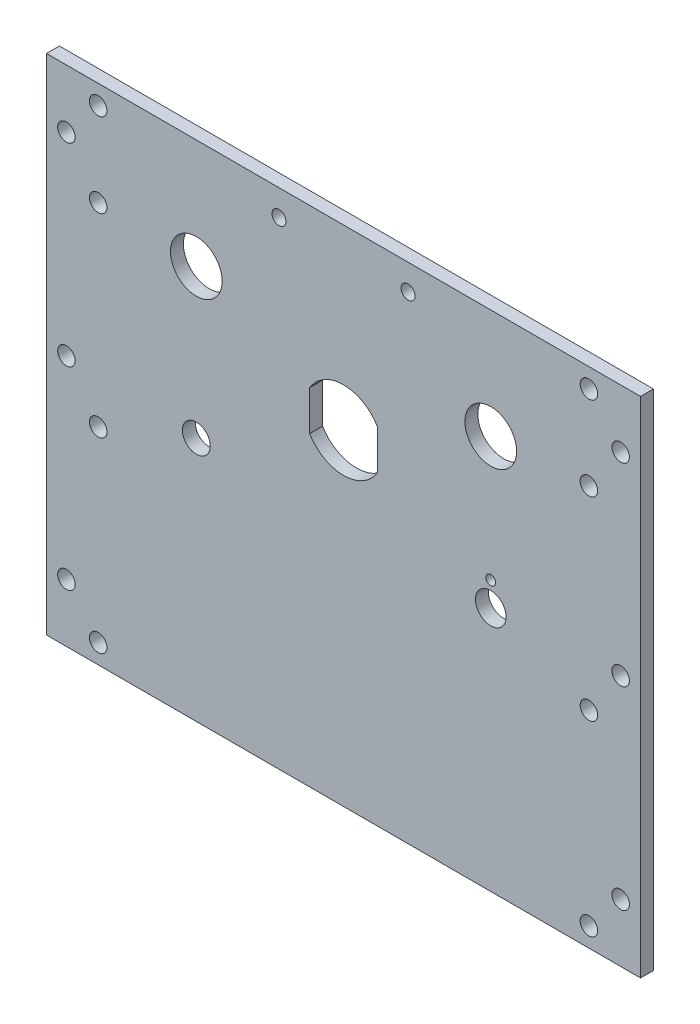
ISO-10303-21;
HEADER;
FILE_DESCRIPTION(('STEP AP214'),'2;1');
FILE_NAME('part.step','',(''),(''),'','','');
FILE_SCHEMA(('AUTOMOTIVE_DESIGN { 1 0 10303 214 1 1 1 1 }'));
ENDSEC;
DATA;
#1=APPLICATION_CONTEXT('core data for automotive mechanical design processes');
#2=APPLICATION_PROTOCOL_DEFINITION('international standard','automotive_design',2000,#1);
#3=PRODUCT_CONTEXT('',#1,'mechanical');
#4=PRODUCT('Part','Part','',(#3));
#5=PRODUCT_RELATED_PRODUCT_CATEGORY('part','',(#4));
#6=PRODUCT_DEFINITION_FORMATION('','',#4);
#7=PRODUCT_DEFINITION_CONTEXT('part definition',#1,'design');
#8=PRODUCT_DEFINITION('design','',#6,#7);
#9=PRODUCT_DEFINITION_SHAPE('','',#8);
#10=(LENGTH_UNIT() NAMED_UNIT(*) SI_UNIT(.MILLI.,.METRE.));
#11=(NAMED_UNIT(*) PLANE_ANGLE_UNIT() SI_UNIT($,.RADIAN.));
#12=(NAMED_UNIT(*) SI_UNIT($,.STERADIAN.) SOLID_ANGLE_UNIT());
#13=UNCERTAINTY_MEASURE_WITH_UNIT(LENGTH_MEASURE(1.E-05),#10,'distance_accuracy_value','');
#14=(GEOMETRIC_REPRESENTATION_CONTEXT(3) GLOBAL_UNCERTAINTY_ASSIGNED_CONTEXT((#13)) GLOBAL_UNIT_ASSIGNED_CONTEXT((#10,
#11,#12)) REPRESENTATION_CONTEXT('',''));
#15=CARTESIAN_POINT('',(0.,0.,0.));
#16=DIRECTION('',(0.,0.,1.));
#17=DIRECTION('',(1.,0.,0.));
#18=AXIS2_PLACEMENT_3D('',#15,#16,#17);
#19=CARTESIAN_POINT('',(0.,0.,-3.175));
#20=DIRECTION('',(1.,0.,0.));
#21=DIRECTION('',(0.,1.,0.));
#22=AXIS2_PLACEMENT_3D('',#19,#20,#21);
#23=PLANE('',#22);
#24=DIRECTION('',(0.,1.,0.));
#25=VECTOR('',#24,1.);
#26=CARTESIAN_POINT('',(0.,0.,0.));
#27=LINE('',#26,#25);
#28=CARTESIAN_POINT('',(0.,0.,0.));
#29=VERTEX_POINT('',#28);
#30=CARTESIAN_POINT('',(0.,123.825,0.));
#31=VERTEX_POINT('',#30);
#32=EDGE_CURVE('E268',#29,#31,#27,.T.);
#33=ORIENTED_EDGE('',*,*,#32,.F.);
#34=DIRECTION('',(0.,0.,1.));
#35=VECTOR('',#34,1.);
#36=CARTESIAN_POINT('',(0.,0.,-3.175));
#37=LINE('',#36,#35);
#38=CARTESIAN_POINT('',(0.,0.,-3.175));
#39=VERTEX_POINT('',#38);
#40=EDGE_CURVE('E13',#39,#29,#37,.T.);
#41=ORIENTED_EDGE('',*,*,#40,.F.);
#42=DIRECTION('',(0.,1.,0.));
#43=VECTOR('',#42,1.);
#44=CARTESIAN_POINT('',(0.,0.,-3.175));
#45=LINE('',#44,#43);
#46=CARTESIAN_POINT('',(0.,123.825,-3.175));
#47=VERTEX_POINT('',#46);
#48=EDGE_CURVE('E269',#39,#47,#45,.T.);
#49=ORIENTED_EDGE('',*,*,#48,.T.);
#50=DIRECTION('',(0.,0.,1.));
#51=VECTOR('',#50,1.);
#52=CARTESIAN_POINT('',(0.,123.825,-3.175));
#53=LINE('',#52,#51);
#54=EDGE_CURVE('E53',#47,#31,#53,.T.);
#55=ORIENTED_EDGE('',*,*,#54,.T.);
#56=EDGE_LOOP('',(#33,#41,#49,#55));
#57=FACE_BOUND('',#56,.T.);
#58=ADVANCED_FACE('F50',(#57),#23,.T.);
#59=CARTESIAN_POINT('',(-146.05,0.,-3.175));
#60=DIRECTION('',(0.,-1.,0.));
#61=DIRECTION('',(1.,0.,0.));
#62=AXIS2_PLACEMENT_3D('',#59,#60,#61);
#63=PLANE('',#62);
#64=DIRECTION('',(1.,0.,0.));
#65=VECTOR('',#64,1.);
#66=CARTESIAN_POINT('',(-146.05,0.,0.));
#67=LINE('',#66,#65);
#68=CARTESIAN_POINT('',(-146.05,0.,0.));
#69=VERTEX_POINT('',#68);
#70=EDGE_CURVE('E273',#69,#29,#67,.T.);
#71=ORIENTED_EDGE('',*,*,#70,.F.);
#72=DIRECTION('',(0.,0.,1.));
#73=VECTOR('',#72,1.);
#74=CARTESIAN_POINT('',(-146.05,0.,-3.175));
#75=LINE('',#74,#73);
#76=CARTESIAN_POINT('',(-146.05,0.,-3.175));
#77=VERTEX_POINT('',#76);
#78=EDGE_CURVE('E58',#77,#69,#75,.T.);
#79=ORIENTED_EDGE('',*,*,#78,.F.);
#80=DIRECTION('',(1.,0.,0.));
#81=VECTOR('',#80,1.);
#82=CARTESIAN_POINT('',(-146.05,0.,-3.175));
#83=LINE('',#82,#81);
#84=EDGE_CURVE('E279',#77,#39,#83,.T.);
#85=ORIENTED_EDGE('',*,*,#84,.T.);
#86=ORIENTED_EDGE('',*,*,#40,.T.);
#87=EDGE_LOOP('',(#71,#79,#85,#86));
#88=FACE_BOUND('',#87,.T.);
#89=ADVANCED_FACE('F304',(#88),#63,.T.);
#90=CARTESIAN_POINT('',(-146.05,123.825,-3.175));
#91=DIRECTION('',(-1.,0.,0.));
#92=DIRECTION('',(0.,0.,1.));
#93=AXIS2_PLACEMENT_3D('',#90,#91,#92);
#94=PLANE('',#93);
#95=DIRECTION('',(0.,-1.,0.));
#96=VECTOR('',#95,1.);
#97=CARTESIAN_POINT('',(-146.05,123.825,0.));
#98=LINE('',#97,#96);
#99=CARTESIAN_POINT('',(-146.05,123.825,0.));
#100=VERTEX_POINT('',#99);
#101=EDGE_CURVE('E287',#100,#69,#98,.T.);
#102=ORIENTED_EDGE('',*,*,#101,.F.);
#103=DIRECTION('',(0.,0.,1.));
#104=VECTOR('',#103,1.);
#105=CARTESIAN_POINT('',(-146.05,123.825,-3.175));
#106=LINE('',#105,#104);
#107=CARTESIAN_POINT('',(-146.05,123.825,-3.175));
#108=VERTEX_POINT('',#107);
#109=EDGE_CURVE('E292',#108,#100,#106,.T.);
#110=ORIENTED_EDGE('',*,*,#109,.F.);
#111=DIRECTION('',(0.,-1.,0.));
#112=VECTOR('',#111,1.);
#113=CARTESIAN_POINT('',(-146.05,123.825,-3.175));
#114=LINE('',#113,#112);
#115=EDGE_CURVE('E276',#108,#77,#114,.T.);
#116=ORIENTED_EDGE('',*,*,#115,.T.);
#117=ORIENTED_EDGE('',*,*,#78,.T.);
#118=EDGE_LOOP('',(#102,#110,#116,#117));
#119=FACE_BOUND('',#118,.T.);
#120=ADVANCED_FACE('F310',(#119),#94,.T.);
#121=CARTESIAN_POINT('',(0.,123.825,-3.175));
#122=DIRECTION('',(0.,1.,0.));
#123=DIRECTION('',(0.,0.,1.));
#124=AXIS2_PLACEMENT_3D('',#121,#122,#123);
#125=PLANE('',#124);
#126=DIRECTION('',(-1.,0.,0.));
#127=VECTOR('',#126,1.);
#128=CARTESIAN_POINT('',(0.,123.825,0.));
#129=LINE('',#128,#127);
#130=EDGE_CURVE('E284',#31,#100,#129,.T.);
#131=ORIENTED_EDGE('',*,*,#130,.F.);
#132=ORIENTED_EDGE('',*,*,#54,.F.);
#133=DIRECTION('',(-1.,0.,0.));
#134=VECTOR('',#133,1.);
#135=CARTESIAN_POINT('',(0.,123.825,-3.175));
#136=LINE('',#135,#134);
#137=EDGE_CURVE('E272',#47,#108,#136,.T.);
#138=ORIENTED_EDGE('',*,*,#137,.T.);
#139=ORIENTED_EDGE('',*,*,#109,.T.);
#140=EDGE_LOOP('',(#131,#132,#138,#139));
#141=FACE_BOUND('',#140,.T.);
#142=ADVANCED_FACE('F300',(#141),#125,.T.);
#143=CARTESIAN_POINT('',(0.,0.,-3.175));
#144=DIRECTION('',(0.,0.,1.));
#145=DIRECTION('',(1.,0.,0.));
#146=AXIS2_PLACEMENT_3D('',#143,#144,#145);
#147=PLANE('',#146);
#148=CARTESIAN_POINT('',(-88.9,117.475,-3.175));
#149=DIRECTION('',(0.,0.,1.));
#150=DIRECTION('',(1.,0.,0.));
#151=AXIS2_PLACEMENT_3D('',#148,#149,#150);
#152=CIRCLE('',#151,1.7272);
#153=CARTESIAN_POINT('',(-87.1728,117.475,-3.175));
#154=VERTEX_POINT('',#153);
#155=EDGE_CURVE('E605',#154,#154,#152,.T.);
#156=ORIENTED_EDGE('',*,*,#155,.T.);
#157=EDGE_LOOP('',(#156));
#158=FACE_BOUND('',#157,.T.);
#159=CARTESIAN_POINT('',(-57.15,117.475,-3.175));
#160=DIRECTION('',(0.,0.,1.));
#161=DIRECTION('',(1.,0.,0.));
#162=AXIS2_PLACEMENT_3D('',#159,#160,#161);
#163=CIRCLE('',#162,1.7272);
#164=CARTESIAN_POINT('',(-55.4228,117.475,-3.175));
#165=VERTEX_POINT('',#164);
#166=EDGE_CURVE('E139',#165,#165,#163,.T.);
#167=ORIENTED_EDGE('',*,*,#166,.T.);
#168=EDGE_LOOP('',(#167));
#169=FACE_BOUND('',#168,.T.);
#170=DIRECTION('',(0.,-1.,0.));
#171=VECTOR('',#170,1.);
#172=CARTESIAN_POINT('',(-64.7065,75.2417306764591,-3.175));
#173=LINE('',#172,#171);
#174=CARTESIAN_POINT('',(-64.7065,85.0322693235408,-3.175));
#175=VERTEX_POINT('',#174);
#176=CARTESIAN_POINT('',(-64.7065,75.2417306764591,-3.175));
#177=VERTEX_POINT('',#176);
#178=EDGE_CURVE('E145',#175,#177,#173,.T.);
#179=ORIENTED_EDGE('',*,*,#178,.F.);
#180=CARTESIAN_POINT('',(-73.025,80.137,-3.175));
#181=DIRECTION('',(0.,0.,-1.));
#182=DIRECTION('',(-1.,0.,0.));
#183=AXIS2_PLACEMENT_3D('',#180,#181,#182);
#184=CIRCLE('',#183,9.652);
#185=CARTESIAN_POINT('',(-81.3435,85.0322693235408,-3.175));
#186=VERTEX_POINT('',#185);
#187=EDGE_CURVE('E66',#186,#175,#184,.T.);
#188=ORIENTED_EDGE('',*,*,#187,.F.);
#189=DIRECTION('',(0.,1.,0.));
#190=VECTOR('',#189,1.);
#191=CARTESIAN_POINT('',(-81.3435,85.0322693235408,-3.175));
#192=LINE('',#191,#190);
#193=CARTESIAN_POINT('',(-81.3435,75.2417306764592,-3.175));
#194=VERTEX_POINT('',#193);
#195=EDGE_CURVE('E133',#194,#186,#192,.T.);
#196=ORIENTED_EDGE('',*,*,#195,.F.);
#197=CARTESIAN_POINT('',(-73.025,80.137,-3.175));
#198=DIRECTION('',(0.,0.,-1.));
#199=DIRECTION('',(-1.,0.,0.));
#200=AXIS2_PLACEMENT_3D('',#197,#198,#199);
#201=CIRCLE('',#200,9.652);
#202=EDGE_CURVE('E136',#177,#194,#201,.T.);
#203=ORIENTED_EDGE('',*,*,#202,.F.);
#204=EDGE_LOOP('',(#179,#188,#196,#203));
#205=FACE_BOUND('',#204,.T.);
#206=CARTESIAN_POINT('',(-109.22,96.901,-3.175));
#207=DIRECTION('',(0.,0.,-1.));
#208=DIRECTION('',(-1.,0.,0.));
#209=AXIS2_PLACEMENT_3D('',#206,#207,#208);
#210=CIRCLE('',#209,6.34999999999999);
#211=CARTESIAN_POINT('',(-115.57,96.901,-3.175));
#212=VERTEX_POINT('',#211);
#213=EDGE_CURVE('E151',#212,#212,#210,.T.);
#214=ORIENTED_EDGE('',*,*,#213,.F.);
#215=EDGE_LOOP('',(#214));
#216=FACE_BOUND('',#215,.T.);
#217=CARTESIAN_POINT('',(-36.8300000264727,66.3249999999963,-3.175));
#218=DIRECTION('',(0.,0.,-1.));
#219=DIRECTION('',(-1.,0.,0.));
#220=AXIS2_PLACEMENT_3D('',#217,#218,#219);
#221=CIRCLE('',#220,1.190625);
#222=CARTESIAN_POINT('',(-38.0206250264727,66.3249999999963,-3.175));
#223=VERTEX_POINT('',#222);
#224=EDGE_CURVE('E158',#223,#223,#221,.T.);
#225=ORIENTED_EDGE('',*,*,#224,.F.);
#226=EDGE_LOOP('',(#225));
#227=FACE_BOUND('',#226,.T.);
#228=CARTESIAN_POINT('',(-109.22,60.325,-3.175));
#229=DIRECTION('',(0.,0.,-1.));
#230=DIRECTION('',(-1.,0.,0.));
#231=AXIS2_PLACEMENT_3D('',#228,#229,#230);
#232=CIRCLE('',#231,3.429);
#233=CARTESIAN_POINT('',(-112.649,60.325,-3.175));
#234=VERTEX_POINT('',#233);
#235=EDGE_CURVE('E164',#234,#234,#232,.T.);
#236=ORIENTED_EDGE('',*,*,#235,.F.);
#237=EDGE_LOOP('',(#236));
#238=FACE_BOUND('',#237,.T.);
#239=CARTESIAN_POINT('',(-36.83,60.325,-3.175));
#240=DIRECTION('',(0.,0.,-1.));
#241=DIRECTION('',(-1.,0.,0.));
#242=AXIS2_PLACEMENT_3D('',#239,#240,#241);
#243=CIRCLE('',#242,3.7703125);
#244=CARTESIAN_POINT('',(-40.6003125,60.325,-3.175));
#245=VERTEX_POINT('',#244);
#246=EDGE_CURVE('E170',#245,#245,#243,.T.);
#247=ORIENTED_EDGE('',*,*,#246,.F.);
#248=EDGE_LOOP('',(#247));
#249=FACE_BOUND('',#248,.T.);
#250=CARTESIAN_POINT('',(-36.83,96.901,-3.175));
#251=DIRECTION('',(0.,0.,-1.));
#252=DIRECTION('',(-1.,0.,0.));
#253=AXIS2_PLACEMENT_3D('',#250,#251,#252);
#254=CIRCLE('',#253,6.35);
#255=CARTESIAN_POINT('',(-43.18,96.901,-3.175));
#256=VERTEX_POINT('',#255);
#257=EDGE_CURVE('E176',#256,#256,#254,.T.);
#258=ORIENTED_EDGE('',*,*,#257,.F.);
#259=EDGE_LOOP('',(#258));
#260=FACE_BOUND('',#259,.T.);
#261=CARTESIAN_POINT('',(-12.7,119.0625,-3.175));
#262=DIRECTION('',(0.,0.,-1.));
#263=DIRECTION('',(-1.,0.,0.));
#264=AXIS2_PLACEMENT_3D('',#261,#262,#263);
#265=CIRCLE('',#264,2.15265);
#266=CARTESIAN_POINT('',(-14.85265,119.0625,-3.175));
#267=VERTEX_POINT('',#266);
#268=EDGE_CURVE('E182',#267,#267,#265,.T.);
#269=ORIENTED_EDGE('',*,*,#268,.F.);
#270=EDGE_LOOP('',(#269));
#271=FACE_BOUND('',#270,.T.);
#272=CARTESIAN_POINT('',(-133.35,119.0625,-3.175));
#273=DIRECTION('',(0.,0.,-1.));
#274=DIRECTION('',(-1.,0.,0.));
#275=AXIS2_PLACEMENT_3D('',#272,#273,#274);
#276=CIRCLE('',#275,2.15265000000001);
#277=CARTESIAN_POINT('',(-135.50265,119.0625,-3.175));
#278=VERTEX_POINT('',#277);
#279=EDGE_CURVE('E190',#278,#278,#276,.T.);
#280=ORIENTED_EDGE('',*,*,#279,.F.);
#281=EDGE_LOOP('',(#280));
#282=FACE_BOUND('',#281,.T.);
#283=CARTESIAN_POINT('',(-141.1605,109.5375,-3.175));
#284=DIRECTION('',(0.,0.,-1.));
#285=DIRECTION('',(-1.,0.,0.));
#286=AXIS2_PLACEMENT_3D('',#283,#284,#285);
#287=CIRCLE('',#286,2.15265000000001);
#288=CARTESIAN_POINT('',(-143.31315,109.5375,-3.175));
#289=VERTEX_POINT('',#288);
#290=EDGE_CURVE('E196',#289,#289,#287,.T.);
#291=ORIENTED_EDGE('',*,*,#290,.F.);
#292=EDGE_LOOP('',(#291));
#293=FACE_BOUND('',#292,.T.);
#294=CARTESIAN_POINT('',(-133.35,98.425,-3.175));
#295=DIRECTION('',(0.,0.,-1.));
#296=DIRECTION('',(-1.,0.,0.));
#297=AXIS2_PLACEMENT_3D('',#294,#295,#296);
#298=CIRCLE('',#297,2.15265000000001);
#299=CARTESIAN_POINT('',(-135.50265,98.425,-3.175));
#300=VERTEX_POINT('',#299);
#301=EDGE_CURVE('E202',#300,#300,#298,.T.);
#302=ORIENTED_EDGE('',*,*,#301,.F.);
#303=EDGE_LOOP('',(#302));
#304=FACE_BOUND('',#303,.T.);
#305=CARTESIAN_POINT('',(-141.1605,61.9125,-3.175));
#306=DIRECTION('',(0.,0.,-1.));
#307=DIRECTION('',(-1.,0.,0.));
#308=AXIS2_PLACEMENT_3D('',#305,#306,#307);
#309=CIRCLE('',#308,2.15265000000001);
#310=CARTESIAN_POINT('',(-143.31315,61.9125,-3.175));
#311=VERTEX_POINT('',#310);
#312=EDGE_CURVE('E208',#311,#311,#309,.T.);
#313=ORIENTED_EDGE('',*,*,#312,.F.);
#314=EDGE_LOOP('',(#313));
#315=FACE_BOUND('',#314,.T.);
#316=CARTESIAN_POINT('',(-133.35,50.673,-3.175));
#317=DIRECTION('',(0.,0.,-1.));
#318=DIRECTION('',(-1.,0.,0.));
#319=AXIS2_PLACEMENT_3D('',#316,#317,#318);
#320=CIRCLE('',#319,2.15265000000001);
#321=CARTESIAN_POINT('',(-135.50265,50.673,-3.175));
#322=VERTEX_POINT('',#321);
#323=EDGE_CURVE('E214',#322,#322,#320,.T.);
#324=ORIENTED_EDGE('',*,*,#323,.F.);
#325=EDGE_LOOP('',(#324));
#326=FACE_BOUND('',#325,.T.);
#327=CARTESIAN_POINT('',(-133.35,4.7625,-3.175));
#328=DIRECTION('',(0.,0.,-1.));
#329=DIRECTION('',(-1.,0.,0.));
#330=AXIS2_PLACEMENT_3D('',#327,#328,#329);
#331=CIRCLE('',#330,2.15265000000001);
#332=CARTESIAN_POINT('',(-135.50265,4.7625,-3.175));
#333=VERTEX_POINT('',#332);
#334=EDGE_CURVE('E220',#333,#333,#331,.T.);
#335=ORIENTED_EDGE('',*,*,#334,.F.);
#336=EDGE_LOOP('',(#335));
#337=FACE_BOUND('',#336,.T.);
#338=CARTESIAN_POINT('',(-12.7,4.7625,-3.175));
#339=DIRECTION('',(0.,0.,-1.));
#340=DIRECTION('',(-1.,0.,0.));
#341=AXIS2_PLACEMENT_3D('',#338,#339,#340);
#342=CIRCLE('',#341,2.15265);
#343=CARTESIAN_POINT('',(-14.85265,4.7625,-3.175));
#344=VERTEX_POINT('',#343);
#345=EDGE_CURVE('E226',#344,#344,#342,.T.);
#346=ORIENTED_EDGE('',*,*,#345,.F.);
#347=EDGE_LOOP('',(#346));
#348=FACE_BOUND('',#347,.T.);
#349=CARTESIAN_POINT('',(-12.7,50.673,-3.175));
#350=DIRECTION('',(0.,0.,-1.));
#351=DIRECTION('',(-1.,0.,0.));
#352=AXIS2_PLACEMENT_3D('',#349,#350,#351);
#353=CIRCLE('',#352,2.15265);
#354=CARTESIAN_POINT('',(-14.85265,50.673,-3.175));
#355=VERTEX_POINT('',#354);
#356=EDGE_CURVE('E232',#355,#355,#353,.T.);
#357=ORIENTED_EDGE('',*,*,#356,.F.);
#358=EDGE_LOOP('',(#357));
#359=FACE_BOUND('',#358,.T.);
#360=CARTESIAN_POINT('',(-12.7,98.425,-3.175));
#361=DIRECTION('',(0.,0.,-1.));
#362=DIRECTION('',(-1.,0.,0.));
#363=AXIS2_PLACEMENT_3D('',#360,#361,#362);
#364=CIRCLE('',#363,2.15265);
#365=CARTESIAN_POINT('',(-14.85265,98.425,-3.175));
#366=VERTEX_POINT('',#365);
#367=EDGE_CURVE('E238',#366,#366,#364,.T.);
#368=ORIENTED_EDGE('',*,*,#367,.F.);
#369=EDGE_LOOP('',(#368));
#370=FACE_BOUND('',#369,.T.);
#371=CARTESIAN_POINT('',(-4.8895,109.5375,-3.175));
#372=DIRECTION('',(0.,0.,-1.));
#373=DIRECTION('',(-1.,0.,0.));
#374=AXIS2_PLACEMENT_3D('',#371,#372,#373);
#375=CIRCLE('',#374,2.15265);
#376=CARTESIAN_POINT('',(-7.04215,109.5375,-3.175));
#377=VERTEX_POINT('',#376);
#378=EDGE_CURVE('E244',#377,#377,#375,.T.);
#379=ORIENTED_EDGE('',*,*,#378,.F.);
#380=EDGE_LOOP('',(#379));
#381=FACE_BOUND('',#380,.T.);
#382=CARTESIAN_POINT('',(-141.1605,14.2875,-3.175));
#383=DIRECTION('',(0.,0.,-1.));
#384=DIRECTION('',(-1.,0.,0.));
#385=AXIS2_PLACEMENT_3D('',#382,#383,#384);
#386=CIRCLE('',#385,2.15265000000001);
#387=CARTESIAN_POINT('',(-143.31315,14.2875,-3.175));
#388=VERTEX_POINT('',#387);
#389=EDGE_CURVE('E250',#388,#388,#386,.T.);
#390=ORIENTED_EDGE('',*,*,#389,.F.);
#391=EDGE_LOOP('',(#390));
#392=FACE_BOUND('',#391,.T.);
#393=CARTESIAN_POINT('',(-4.88949999999997,14.2875,-3.175));
#394=DIRECTION('',(0.,0.,-1.));
#395=DIRECTION('',(-1.,0.,0.));
#396=AXIS2_PLACEMENT_3D('',#393,#394,#395);
#397=CIRCLE('',#396,2.15265);
#398=CARTESIAN_POINT('',(-7.04214999999997,14.2875,-3.175));
#399=VERTEX_POINT('',#398);
#400=EDGE_CURVE('E256',#399,#399,#397,.T.);
#401=ORIENTED_EDGE('',*,*,#400,.F.);
#402=EDGE_LOOP('',(#401));
#403=FACE_BOUND('',#402,.T.);
#404=CARTESIAN_POINT('',(-4.8895,61.9125,-3.175));
#405=DIRECTION('',(0.,0.,-1.));
#406=DIRECTION('',(-1.,0.,0.));
#407=AXIS2_PLACEMENT_3D('',#404,#405,#406);
#408=CIRCLE('',#407,2.15265);
#409=CARTESIAN_POINT('',(-7.04215,61.9125,-3.175));
#410=VERTEX_POINT('',#409);
#411=EDGE_CURVE('E262',#410,#410,#408,.T.);
#412=ORIENTED_EDGE('',*,*,#411,.F.);
#413=EDGE_LOOP('',(#412));
#414=FACE_BOUND('',#413,.T.);
#415=ORIENTED_EDGE('',*,*,#48,.F.);
#416=ORIENTED_EDGE('',*,*,#84,.F.);
#417=ORIENTED_EDGE('',*,*,#115,.F.);
#418=ORIENTED_EDGE('',*,*,#137,.F.);
#419=EDGE_LOOP('',(#415,#416,#417,#418));
#420=FACE_BOUND('',#419,.T.);
#421=ADVANCED_FACE('F307',(#158,#169,#205,#216,#227,#238,#249,#260,#271,#282,#293,#304,#315,
#326,#337,#348,#359,#370,#381,#392,#403,#414,#420),#147,.F.);
#422=CARTESIAN_POINT('',(0.,0.,0.));
#423=DIRECTION('',(0.,0.,1.));
#424=DIRECTION('',(1.,0.,0.));
#425=AXIS2_PLACEMENT_3D('',#422,#423,#424);
#426=PLANE('',#425);
#427=CARTESIAN_POINT('',(-88.9,117.475,0.));
#428=DIRECTION('',(0.,0.,1.));
#429=DIRECTION('',(1.,0.,0.));
#430=AXIS2_PLACEMENT_3D('',#427,#428,#429);
#431=CIRCLE('',#430,1.7272);
#432=CARTESIAN_POINT('',(-87.1728,117.475,0.));
#433=VERTEX_POINT('',#432);
#434=EDGE_CURVE('E608',#433,#433,#431,.T.);
#435=ORIENTED_EDGE('',*,*,#434,.F.);
#436=EDGE_LOOP('',(#435));
#437=FACE_BOUND('',#436,.T.);
#438=CARTESIAN_POINT('',(-57.15,117.475,0.));
#439=DIRECTION('',(0.,0.,1.));
#440=DIRECTION('',(1.,0.,0.));
#441=AXIS2_PLACEMENT_3D('',#438,#439,#440);
#442=CIRCLE('',#441,1.7272);
#443=CARTESIAN_POINT('',(-55.4228,117.475,0.));
#444=VERTEX_POINT('',#443);
#445=EDGE_CURVE('E610',#444,#444,#442,.T.);
#446=ORIENTED_EDGE('',*,*,#445,.F.);
#447=EDGE_LOOP('',(#446));
#448=FACE_BOUND('',#447,.T.);
#449=CARTESIAN_POINT('',(-73.025,80.137,0.));
#450=DIRECTION('',(0.,0.,-1.));
#451=DIRECTION('',(-1.,0.,0.));
#452=AXIS2_PLACEMENT_3D('',#449,#450,#451);
#453=CIRCLE('',#452,9.652);
#454=CARTESIAN_POINT('',(-81.3435,85.0322693235408,0.));
#455=VERTEX_POINT('',#454);
#456=CARTESIAN_POINT('',(-64.7065,85.0322693235408,0.));
#457=VERTEX_POINT('',#456);
#458=EDGE_CURVE('E117',#455,#457,#453,.T.);
#459=ORIENTED_EDGE('',*,*,#458,.T.);
#460=DIRECTION('',(0.,-1.,0.));
#461=VECTOR('',#460,1.);
#462=CARTESIAN_POINT('',(-64.7065,75.2417306764591,0.));
#463=LINE('',#462,#461);
#464=CARTESIAN_POINT('',(-64.7065,75.2417306764591,0.));
#465=VERTEX_POINT('',#464);
#466=EDGE_CURVE('E126',#457,#465,#463,.T.);
#467=ORIENTED_EDGE('',*,*,#466,.T.);
#468=CARTESIAN_POINT('',(-73.025,80.137,0.));
#469=DIRECTION('',(0.,0.,-1.));
#470=DIRECTION('',(-1.,0.,0.));
#471=AXIS2_PLACEMENT_3D('',#468,#469,#470);
#472=CIRCLE('',#471,9.652);
#473=CARTESIAN_POINT('',(-81.3435,75.2417306764592,0.));
#474=VERTEX_POINT('',#473);
#475=EDGE_CURVE('E74',#465,#474,#472,.T.);
#476=ORIENTED_EDGE('',*,*,#475,.T.);
#477=DIRECTION('',(0.,1.,0.));
#478=VECTOR('',#477,1.);
#479=CARTESIAN_POINT('',(-81.3435,85.0322693235408,0.));
#480=LINE('',#479,#478);
#481=EDGE_CURVE('E123',#474,#455,#480,.T.);
#482=ORIENTED_EDGE('',*,*,#481,.T.);
#483=EDGE_LOOP('',(#459,#467,#476,#482));
#484=FACE_BOUND('',#483,.T.);
#485=CARTESIAN_POINT('',(-109.22,96.901,0.));
#486=DIRECTION('',(0.,0.,-1.));
#487=DIRECTION('',(-1.,0.,0.));
#488=AXIS2_PLACEMENT_3D('',#485,#486,#487);
#489=CIRCLE('',#488,6.34999999999999);
#490=CARTESIAN_POINT('',(-115.57,96.901,0.));
#491=VERTEX_POINT('',#490);
#492=EDGE_CURVE('E155',#491,#491,#489,.T.);
#493=ORIENTED_EDGE('',*,*,#492,.T.);
#494=EDGE_LOOP('',(#493));
#495=FACE_BOUND('',#494,.T.);
#496=CARTESIAN_POINT('',(-36.8300000264727,66.3249999999963,0.));
#497=DIRECTION('',(0.,0.,-1.));
#498=DIRECTION('',(-1.,0.,0.));
#499=AXIS2_PLACEMENT_3D('',#496,#497,#498);
#500=CIRCLE('',#499,1.190625);
#501=CARTESIAN_POINT('',(-38.0206250264727,66.3249999999963,0.));
#502=VERTEX_POINT('',#501);
#503=EDGE_CURVE('E161',#502,#502,#500,.T.);
#504=ORIENTED_EDGE('',*,*,#503,.T.);
#505=EDGE_LOOP('',(#504));
#506=FACE_BOUND('',#505,.T.);
#507=CARTESIAN_POINT('',(-109.22,60.325,0.));
#508=DIRECTION('',(0.,0.,-1.));
#509=DIRECTION('',(-1.,0.,0.));
#510=AXIS2_PLACEMENT_3D('',#507,#508,#509);
#511=CIRCLE('',#510,3.429);
#512=CARTESIAN_POINT('',(-112.649,60.325,0.));
#513=VERTEX_POINT('',#512);
#514=EDGE_CURVE('E167',#513,#513,#511,.T.);
#515=ORIENTED_EDGE('',*,*,#514,.T.);
#516=EDGE_LOOP('',(#515));
#517=FACE_BOUND('',#516,.T.);
#518=CARTESIAN_POINT('',(-36.83,60.325,0.));
#519=DIRECTION('',(0.,0.,-1.));
#520=DIRECTION('',(-1.,0.,0.));
#521=AXIS2_PLACEMENT_3D('',#518,#519,#520);
#522=CIRCLE('',#521,3.7703125);
#523=CARTESIAN_POINT('',(-40.6003125,60.325,0.));
#524=VERTEX_POINT('',#523);
#525=EDGE_CURVE('E173',#524,#524,#522,.T.);
#526=ORIENTED_EDGE('',*,*,#525,.T.);
#527=EDGE_LOOP('',(#526));
#528=FACE_BOUND('',#527,.T.);
#529=CARTESIAN_POINT('',(-36.83,96.901,0.));
#530=DIRECTION('',(0.,0.,-1.));
#531=DIRECTION('',(-1.,0.,0.));
#532=AXIS2_PLACEMENT_3D('',#529,#530,#531);
#533=CIRCLE('',#532,6.35);
#534=CARTESIAN_POINT('',(-43.18,96.901,0.));
#535=VERTEX_POINT('',#534);
#536=EDGE_CURVE('E179',#535,#535,#533,.T.);
#537=ORIENTED_EDGE('',*,*,#536,.T.);
#538=EDGE_LOOP('',(#537));
#539=FACE_BOUND('',#538,.T.);
#540=CARTESIAN_POINT('',(-12.7,119.0625,0.));
#541=DIRECTION('',(0.,0.,-1.));
#542=DIRECTION('',(-1.,0.,0.));
#543=AXIS2_PLACEMENT_3D('',#540,#541,#542);
#544=CIRCLE('',#543,2.15265);
#545=CARTESIAN_POINT('',(-14.85265,119.0625,0.));
#546=VERTEX_POINT('',#545);
#547=EDGE_CURVE('E187',#546,#546,#544,.T.);
#548=ORIENTED_EDGE('',*,*,#547,.T.);
#549=EDGE_LOOP('',(#548));
#550=FACE_BOUND('',#549,.T.);
#551=CARTESIAN_POINT('',(-133.35,119.0625,0.));
#552=DIRECTION('',(0.,0.,-1.));
#553=DIRECTION('',(-1.,0.,0.));
#554=AXIS2_PLACEMENT_3D('',#551,#552,#553);
#555=CIRCLE('',#554,2.15265000000001);
#556=CARTESIAN_POINT('',(-135.50265,119.0625,0.));
#557=VERTEX_POINT('',#556);
#558=EDGE_CURVE('E193',#557,#557,#555,.T.);
#559=ORIENTED_EDGE('',*,*,#558,.T.);
#560=EDGE_LOOP('',(#559));
#561=FACE_BOUND('',#560,.T.);
#562=CARTESIAN_POINT('',(-141.1605,109.5375,0.));
#563=DIRECTION('',(0.,0.,-1.));
#564=DIRECTION('',(-1.,0.,0.));
#565=AXIS2_PLACEMENT_3D('',#562,#563,#564);
#566=CIRCLE('',#565,2.15265000000001);
#567=CARTESIAN_POINT('',(-143.31315,109.5375,0.));
#568=VERTEX_POINT('',#567);
#569=EDGE_CURVE('E199',#568,#568,#566,.T.);
#570=ORIENTED_EDGE('',*,*,#569,.T.);
#571=EDGE_LOOP('',(#570));
#572=FACE_BOUND('',#571,.T.);
#573=CARTESIAN_POINT('',(-133.35,98.425,0.));
#574=DIRECTION('',(0.,0.,-1.));
#575=DIRECTION('',(-1.,0.,0.));
#576=AXIS2_PLACEMENT_3D('',#573,#574,#575);
#577=CIRCLE('',#576,2.15265000000001);
#578=CARTESIAN_POINT('',(-135.50265,98.425,0.));
#579=VERTEX_POINT('',#578);
#580=EDGE_CURVE('E205',#579,#579,#577,.T.);
#581=ORIENTED_EDGE('',*,*,#580,.T.);
#582=EDGE_LOOP('',(#581));
#583=FACE_BOUND('',#582,.T.);
#584=CARTESIAN_POINT('',(-141.1605,61.9125,0.));
#585=DIRECTION('',(0.,0.,-1.));
#586=DIRECTION('',(-1.,0.,0.));
#587=AXIS2_PLACEMENT_3D('',#584,#585,#586);
#588=CIRCLE('',#587,2.15265000000001);
#589=CARTESIAN_POINT('',(-143.31315,61.9125,0.));
#590=VERTEX_POINT('',#589);
#591=EDGE_CURVE('E211',#590,#590,#588,.T.);
#592=ORIENTED_EDGE('',*,*,#591,.T.);
#593=EDGE_LOOP('',(#592));
#594=FACE_BOUND('',#593,.T.);
#595=CARTESIAN_POINT('',(-133.35,50.673,0.));
#596=DIRECTION('',(0.,0.,-1.));
#597=DIRECTION('',(-1.,0.,0.));
#598=AXIS2_PLACEMENT_3D('',#595,#596,#597);
#599=CIRCLE('',#598,2.15265000000001);
#600=CARTESIAN_POINT('',(-135.50265,50.673,0.));
#601=VERTEX_POINT('',#600);
#602=EDGE_CURVE('E217',#601,#601,#599,.T.);
#603=ORIENTED_EDGE('',*,*,#602,.T.);
#604=EDGE_LOOP('',(#603));
#605=FACE_BOUND('',#604,.T.);
#606=CARTESIAN_POINT('',(-133.35,4.7625,0.));
#607=DIRECTION('',(0.,0.,-1.));
#608=DIRECTION('',(-1.,0.,0.));
#609=AXIS2_PLACEMENT_3D('',#606,#607,#608);
#610=CIRCLE('',#609,2.15265000000001);
#611=CARTESIAN_POINT('',(-135.50265,4.7625,0.));
#612=VERTEX_POINT('',#611);
#613=EDGE_CURVE('E223',#612,#612,#610,.T.);
#614=ORIENTED_EDGE('',*,*,#613,.T.);
#615=EDGE_LOOP('',(#614));
#616=FACE_BOUND('',#615,.T.);
#617=CARTESIAN_POINT('',(-12.7,4.7625,0.));
#618=DIRECTION('',(0.,0.,-1.));
#619=DIRECTION('',(-1.,0.,0.));
#620=AXIS2_PLACEMENT_3D('',#617,#618,#619);
#621=CIRCLE('',#620,2.15265);
#622=CARTESIAN_POINT('',(-14.85265,4.7625,0.));
#623=VERTEX_POINT('',#622);
#624=EDGE_CURVE('E229',#623,#623,#621,.T.);
#625=ORIENTED_EDGE('',*,*,#624,.T.);
#626=EDGE_LOOP('',(#625));
#627=FACE_BOUND('',#626,.T.);
#628=CARTESIAN_POINT('',(-12.7,50.673,0.));
#629=DIRECTION('',(0.,0.,-1.));
#630=DIRECTION('',(-1.,0.,0.));
#631=AXIS2_PLACEMENT_3D('',#628,#629,#630);
#632=CIRCLE('',#631,2.15265);
#633=CARTESIAN_POINT('',(-14.85265,50.673,0.));
#634=VERTEX_POINT('',#633);
#635=EDGE_CURVE('E235',#634,#634,#632,.T.);
#636=ORIENTED_EDGE('',*,*,#635,.T.);
#637=EDGE_LOOP('',(#636));
#638=FACE_BOUND('',#637,.T.);
#639=CARTESIAN_POINT('',(-12.7,98.425,0.));
#640=DIRECTION('',(0.,0.,-1.));
#641=DIRECTION('',(-1.,0.,0.));
#642=AXIS2_PLACEMENT_3D('',#639,#640,#641);
#643=CIRCLE('',#642,2.15265);
#644=CARTESIAN_POINT('',(-14.85265,98.425,0.));
#645=VERTEX_POINT('',#644);
#646=EDGE_CURVE('E241',#645,#645,#643,.T.);
#647=ORIENTED_EDGE('',*,*,#646,.T.);
#648=EDGE_LOOP('',(#647));
#649=FACE_BOUND('',#648,.T.);
#650=CARTESIAN_POINT('',(-4.8895,109.5375,0.));
#651=DIRECTION('',(0.,0.,-1.));
#652=DIRECTION('',(-1.,0.,0.));
#653=AXIS2_PLACEMENT_3D('',#650,#651,#652);
#654=CIRCLE('',#653,2.15265);
#655=CARTESIAN_POINT('',(-7.04215,109.5375,0.));
#656=VERTEX_POINT('',#655);
#657=EDGE_CURVE('E247',#656,#656,#654,.T.);
#658=ORIENTED_EDGE('',*,*,#657,.T.);
#659=EDGE_LOOP('',(#658));
#660=FACE_BOUND('',#659,.T.);
#661=CARTESIAN_POINT('',(-141.1605,14.2875,0.));
#662=DIRECTION('',(0.,0.,-1.));
#663=DIRECTION('',(-1.,0.,0.));
#664=AXIS2_PLACEMENT_3D('',#661,#662,#663);
#665=CIRCLE('',#664,2.15265000000001);
#666=CARTESIAN_POINT('',(-143.31315,14.2875,0.));
#667=VERTEX_POINT('',#666);
#668=EDGE_CURVE('E253',#667,#667,#665,.T.);
#669=ORIENTED_EDGE('',*,*,#668,.T.);
#670=EDGE_LOOP('',(#669));
#671=FACE_BOUND('',#670,.T.);
#672=CARTESIAN_POINT('',(-4.88949999999997,14.2875,0.));
#673=DIRECTION('',(0.,0.,-1.));
#674=DIRECTION('',(-1.,0.,0.));
#675=AXIS2_PLACEMENT_3D('',#672,#673,#674);
#676=CIRCLE('',#675,2.15265);
#677=CARTESIAN_POINT('',(-7.04214999999997,14.2875,0.));
#678=VERTEX_POINT('',#677);
#679=EDGE_CURVE('E259',#678,#678,#676,.T.);
#680=ORIENTED_EDGE('',*,*,#679,.T.);
#681=EDGE_LOOP('',(#680));
#682=FACE_BOUND('',#681,.T.);
#683=CARTESIAN_POINT('',(-4.8895,61.9125,0.));
#684=DIRECTION('',(0.,0.,-1.));
#685=DIRECTION('',(-1.,0.,0.));
#686=AXIS2_PLACEMENT_3D('',#683,#684,#685);
#687=CIRCLE('',#686,2.15265);
#688=CARTESIAN_POINT('',(-7.04215,61.9125,0.));
#689=VERTEX_POINT('',#688);
#690=EDGE_CURVE('E265',#689,#689,#687,.T.);
#691=ORIENTED_EDGE('',*,*,#690,.T.);
#692=EDGE_LOOP('',(#691));
#693=FACE_BOUND('',#692,.T.);
#694=ORIENTED_EDGE('',*,*,#32,.T.);
#695=ORIENTED_EDGE('',*,*,#130,.T.);
#696=ORIENTED_EDGE('',*,*,#101,.T.);
#697=ORIENTED_EDGE('',*,*,#70,.T.);
#698=EDGE_LOOP('',(#694,#695,#696,#697));
#699=FACE_BOUND('',#698,.T.);
#700=ADVANCED_FACE('F130',(#437,#448,#484,#495,#506,#517,#528,#539,#550,#561,#572,#583,#594,
#605,#616,#627,#638,#649,#660,#671,#682,#693,#699),#426,.T.);
#701=CARTESIAN_POINT('',(-4.8895,61.9125,-3.175));
#702=DIRECTION('',(0.,0.,-1.));
#703=DIRECTION('',(-1.,0.,0.));
#704=AXIS2_PLACEMENT_3D('',#701,#702,#703);
#705=CYLINDRICAL_SURFACE('',#704,2.15265);
#706=ORIENTED_EDGE('',*,*,#690,.F.);
#707=EDGE_LOOP('',(#706));
#708=FACE_BOUND('',#707,.T.);
#709=ORIENTED_EDGE('',*,*,#411,.T.);
#710=EDGE_LOOP('',(#709));
#711=FACE_BOUND('',#710,.T.);
#712=ADVANCED_FACE('F342',(#708,#711),#705,.F.);
#713=CARTESIAN_POINT('',(-4.88949999999997,14.2875,-3.175));
#714=DIRECTION('',(0.,0.,-1.));
#715=DIRECTION('',(-1.,0.,0.));
#716=AXIS2_PLACEMENT_3D('',#713,#714,#715);
#717=CYLINDRICAL_SURFACE('',#716,2.15265);
#718=ORIENTED_EDGE('',*,*,#679,.F.);
#719=EDGE_LOOP('',(#718));
#720=FACE_BOUND('',#719,.T.);
#721=ORIENTED_EDGE('',*,*,#400,.T.);
#722=EDGE_LOOP('',(#721));
#723=FACE_BOUND('',#722,.T.);
#724=ADVANCED_FACE('F347',(#720,#723),#717,.F.);
#725=CARTESIAN_POINT('',(-141.1605,14.2875,-3.175));
#726=DIRECTION('',(0.,0.,-1.));
#727=DIRECTION('',(-1.,0.,0.));
#728=AXIS2_PLACEMENT_3D('',#725,#726,#727);
#729=CYLINDRICAL_SURFACE('',#728,2.15265000000001);
#730=ORIENTED_EDGE('',*,*,#668,.F.);
#731=EDGE_LOOP('',(#730));
#732=FACE_BOUND('',#731,.T.);
#733=ORIENTED_EDGE('',*,*,#389,.T.);
#734=EDGE_LOOP('',(#733));
#735=FACE_BOUND('',#734,.T.);
#736=ADVANCED_FACE('F359',(#732,#735),#729,.F.);
#737=CARTESIAN_POINT('',(-4.8895,109.5375,-3.175));
#738=DIRECTION('',(0.,0.,-1.));
#739=DIRECTION('',(-1.,0.,0.));
#740=AXIS2_PLACEMENT_3D('',#737,#738,#739);
#741=CYLINDRICAL_SURFACE('',#740,2.15265);
#742=ORIENTED_EDGE('',*,*,#657,.F.);
#743=EDGE_LOOP('',(#742));
#744=FACE_BOUND('',#743,.T.);
#745=ORIENTED_EDGE('',*,*,#378,.T.);
#746=EDGE_LOOP('',(#745));
#747=FACE_BOUND('',#746,.T.);
#748=ADVANCED_FACE('F369',(#744,#747),#741,.F.);
#749=CARTESIAN_POINT('',(-12.7,98.425,-3.175));
#750=DIRECTION('',(0.,0.,-1.));
#751=DIRECTION('',(-1.,0.,0.));
#752=AXIS2_PLACEMENT_3D('',#749,#750,#751);
#753=CYLINDRICAL_SURFACE('',#752,2.15265);
#754=ORIENTED_EDGE('',*,*,#646,.F.);
#755=EDGE_LOOP('',(#754));
#756=FACE_BOUND('',#755,.T.);
#757=ORIENTED_EDGE('',*,*,#367,.T.);
#758=EDGE_LOOP('',(#757));
#759=FACE_BOUND('',#758,.T.);
#760=ADVANCED_FACE('F379',(#756,#759),#753,.F.);
#761=CARTESIAN_POINT('',(-12.7,50.673,-3.175));
#762=DIRECTION('',(0.,0.,-1.));
#763=DIRECTION('',(-1.,0.,0.));
#764=AXIS2_PLACEMENT_3D('',#761,#762,#763);
#765=CYLINDRICAL_SURFACE('',#764,2.15265);
#766=ORIENTED_EDGE('',*,*,#635,.F.);
#767=EDGE_LOOP('',(#766));
#768=FACE_BOUND('',#767,.T.);
#769=ORIENTED_EDGE('',*,*,#356,.T.);
#770=EDGE_LOOP('',(#769));
#771=FACE_BOUND('',#770,.T.);
#772=ADVANCED_FACE('F389',(#768,#771),#765,.F.);
#773=CARTESIAN_POINT('',(-12.7,4.7625,-3.175));
#774=DIRECTION('',(0.,0.,-1.));
#775=DIRECTION('',(-1.,0.,0.));
#776=AXIS2_PLACEMENT_3D('',#773,#774,#775);
#777=CYLINDRICAL_SURFACE('',#776,2.15265);
#778=ORIENTED_EDGE('',*,*,#624,.F.);
#779=EDGE_LOOP('',(#778));
#780=FACE_BOUND('',#779,.T.);
#781=ORIENTED_EDGE('',*,*,#345,.T.);
#782=EDGE_LOOP('',(#781));
#783=FACE_BOUND('',#782,.T.);
#784=ADVANCED_FACE('F399',(#780,#783),#777,.F.);
#785=CARTESIAN_POINT('',(-133.35,4.7625,-3.175));
#786=DIRECTION('',(0.,0.,-1.));
#787=DIRECTION('',(-1.,0.,0.));
#788=AXIS2_PLACEMENT_3D('',#785,#786,#787);
#789=CYLINDRICAL_SURFACE('',#788,2.15265000000001);
#790=ORIENTED_EDGE('',*,*,#613,.F.);
#791=EDGE_LOOP('',(#790));
#792=FACE_BOUND('',#791,.T.);
#793=ORIENTED_EDGE('',*,*,#334,.T.);
#794=EDGE_LOOP('',(#793));
#795=FACE_BOUND('',#794,.T.);
#796=ADVANCED_FACE('F409',(#792,#795),#789,.F.);
#797=CARTESIAN_POINT('',(-133.35,50.673,-3.175));
#798=DIRECTION('',(0.,0.,-1.));
#799=DIRECTION('',(-1.,0.,0.));
#800=AXIS2_PLACEMENT_3D('',#797,#798,#799);
#801=CYLINDRICAL_SURFACE('',#800,2.15265000000001);
#802=ORIENTED_EDGE('',*,*,#602,.F.);
#803=EDGE_LOOP('',(#802));
#804=FACE_BOUND('',#803,.T.);
#805=ORIENTED_EDGE('',*,*,#323,.T.);
#806=EDGE_LOOP('',(#805));
#807=FACE_BOUND('',#806,.T.);
#808=ADVANCED_FACE('F419',(#804,#807),#801,.F.);
#809=CARTESIAN_POINT('',(-141.1605,61.9125,-3.175));
#810=DIRECTION('',(0.,0.,-1.));
#811=DIRECTION('',(-1.,0.,0.));
#812=AXIS2_PLACEMENT_3D('',#809,#810,#811);
#813=CYLINDRICAL_SURFACE('',#812,2.15265000000001);
#814=ORIENTED_EDGE('',*,*,#591,.F.);
#815=EDGE_LOOP('',(#814));
#816=FACE_BOUND('',#815,.T.);
#817=ORIENTED_EDGE('',*,*,#312,.T.);
#818=EDGE_LOOP('',(#817));
#819=FACE_BOUND('',#818,.T.);
#820=ADVANCED_FACE('F429',(#816,#819),#813,.F.);
#821=CARTESIAN_POINT('',(-133.35,98.425,-3.175));
#822=DIRECTION('',(0.,0.,-1.));
#823=DIRECTION('',(-1.,0.,0.));
#824=AXIS2_PLACEMENT_3D('',#821,#822,#823);
#825=CYLINDRICAL_SURFACE('',#824,2.15265000000001);
#826=ORIENTED_EDGE('',*,*,#580,.F.);
#827=EDGE_LOOP('',(#826));
#828=FACE_BOUND('',#827,.T.);
#829=ORIENTED_EDGE('',*,*,#301,.T.);
#830=EDGE_LOOP('',(#829));
#831=FACE_BOUND('',#830,.T.);
#832=ADVANCED_FACE('F439',(#828,#831),#825,.F.);
#833=CARTESIAN_POINT('',(-141.1605,109.5375,-3.175));
#834=DIRECTION('',(0.,0.,-1.));
#835=DIRECTION('',(-1.,0.,0.));
#836=AXIS2_PLACEMENT_3D('',#833,#834,#835);
#837=CYLINDRICAL_SURFACE('',#836,2.15265000000001);
#838=ORIENTED_EDGE('',*,*,#569,.F.);
#839=EDGE_LOOP('',(#838));
#840=FACE_BOUND('',#839,.T.);
#841=ORIENTED_EDGE('',*,*,#290,.T.);
#842=EDGE_LOOP('',(#841));
#843=FACE_BOUND('',#842,.T.);
#844=ADVANCED_FACE('F449',(#840,#843),#837,.F.);
#845=CARTESIAN_POINT('',(-133.35,119.0625,-3.175));
#846=DIRECTION('',(0.,0.,-1.));
#847=DIRECTION('',(-1.,0.,0.));
#848=AXIS2_PLACEMENT_3D('',#845,#846,#847);
#849=CYLINDRICAL_SURFACE('',#848,2.15265000000001);
#850=ORIENTED_EDGE('',*,*,#558,.F.);
#851=EDGE_LOOP('',(#850));
#852=FACE_BOUND('',#851,.T.);
#853=ORIENTED_EDGE('',*,*,#279,.T.);
#854=EDGE_LOOP('',(#853));
#855=FACE_BOUND('',#854,.T.);
#856=ADVANCED_FACE('F459',(#852,#855),#849,.F.);
#857=CARTESIAN_POINT('',(-12.7,119.0625,-3.175));
#858=DIRECTION('',(0.,0.,-1.));
#859=DIRECTION('',(-1.,0.,0.));
#860=AXIS2_PLACEMENT_3D('',#857,#858,#859);
#861=CYLINDRICAL_SURFACE('',#860,2.15265);
#862=ORIENTED_EDGE('',*,*,#547,.F.);
#863=EDGE_LOOP('',(#862));
#864=FACE_BOUND('',#863,.T.);
#865=ORIENTED_EDGE('',*,*,#268,.T.);
#866=EDGE_LOOP('',(#865));
#867=FACE_BOUND('',#866,.T.);
#868=ADVANCED_FACE('F469',(#864,#867),#861,.F.);
#869=CARTESIAN_POINT('',(-36.83,96.901,0.));
#870=DIRECTION('',(0.,0.,-1.));
#871=DIRECTION('',(-1.,0.,0.));
#872=AXIS2_PLACEMENT_3D('',#869,#870,#871);
#873=CYLINDRICAL_SURFACE('',#872,6.35);
#874=ORIENTED_EDGE('',*,*,#536,.F.);
#875=EDGE_LOOP('',(#874));
#876=FACE_BOUND('',#875,.T.);
#877=ORIENTED_EDGE('',*,*,#257,.T.);
#878=EDGE_LOOP('',(#877));
#879=FACE_BOUND('',#878,.T.);
#880=ADVANCED_FACE('F479',(#876,#879),#873,.F.);
#881=CARTESIAN_POINT('',(-36.83,60.325,0.));
#882=DIRECTION('',(0.,0.,-1.));
#883=DIRECTION('',(-1.,0.,0.));
#884=AXIS2_PLACEMENT_3D('',#881,#882,#883);
#885=CYLINDRICAL_SURFACE('',#884,3.7703125);
#886=ORIENTED_EDGE('',*,*,#525,.F.);
#887=EDGE_LOOP('',(#886));
#888=FACE_BOUND('',#887,.T.);
#889=ORIENTED_EDGE('',*,*,#246,.T.);
#890=EDGE_LOOP('',(#889));
#891=FACE_BOUND('',#890,.T.);
#892=ADVANCED_FACE('F489',(#888,#891),#885,.F.);
#893=CARTESIAN_POINT('',(-109.22,60.325,0.));
#894=DIRECTION('',(0.,0.,-1.));
#895=DIRECTION('',(-1.,0.,0.));
#896=AXIS2_PLACEMENT_3D('',#893,#894,#895);
#897=CYLINDRICAL_SURFACE('',#896,3.429);
#898=ORIENTED_EDGE('',*,*,#514,.F.);
#899=EDGE_LOOP('',(#898));
#900=FACE_BOUND('',#899,.T.);
#901=ORIENTED_EDGE('',*,*,#235,.T.);
#902=EDGE_LOOP('',(#901));
#903=FACE_BOUND('',#902,.T.);
#904=ADVANCED_FACE('F499',(#900,#903),#897,.F.);
#905=CARTESIAN_POINT('',(-36.8300000264727,66.3249999999963,0.));
#906=DIRECTION('',(0.,0.,-1.));
#907=DIRECTION('',(-1.,0.,0.));
#908=AXIS2_PLACEMENT_3D('',#905,#906,#907);
#909=CYLINDRICAL_SURFACE('',#908,1.190625);
#910=ORIENTED_EDGE('',*,*,#503,.F.);
#911=EDGE_LOOP('',(#910));
#912=FACE_BOUND('',#911,.T.);
#913=ORIENTED_EDGE('',*,*,#224,.T.);
#914=EDGE_LOOP('',(#913));
#915=FACE_BOUND('',#914,.T.);
#916=ADVANCED_FACE('F509',(#912,#915),#909,.F.);
#917=CARTESIAN_POINT('',(-109.22,96.901,0.));
#918=DIRECTION('',(0.,0.,-1.));
#919=DIRECTION('',(-1.,0.,0.));
#920=AXIS2_PLACEMENT_3D('',#917,#918,#919);
#921=CYLINDRICAL_SURFACE('',#920,6.34999999999999);
#922=ORIENTED_EDGE('',*,*,#492,.F.);
#923=EDGE_LOOP('',(#922));
#924=FACE_BOUND('',#923,.T.);
#925=ORIENTED_EDGE('',*,*,#213,.T.);
#926=EDGE_LOOP('',(#925));
#927=FACE_BOUND('',#926,.T.);
#928=ADVANCED_FACE('F519',(#924,#927),#921,.F.);
#929=CARTESIAN_POINT('',(-73.025,80.137,0.));
#930=DIRECTION('',(0.,0.,-1.));
#931=DIRECTION('',(-1.,0.,0.));
#932=AXIS2_PLACEMENT_3D('',#929,#930,#931);
#933=CYLINDRICAL_SURFACE('',#932,9.652);
#934=ORIENTED_EDGE('',*,*,#187,.T.);
#935=DIRECTION('',(0.,0.,-1.));
#936=VECTOR('',#935,1.);
#937=CARTESIAN_POINT('',(-64.7065,85.0322693235408,0.));
#938=LINE('',#937,#936);
#939=EDGE_CURVE('E113',#457,#175,#938,.T.);
#940=ORIENTED_EDGE('',*,*,#939,.F.);
#941=ORIENTED_EDGE('',*,*,#458,.F.);
#942=DIRECTION('',(0.,0.,-1.));
#943=VECTOR('',#942,1.);
#944=CARTESIAN_POINT('',(-81.3435,85.0322693235408,0.));
#945=LINE('',#944,#943);
#946=EDGE_CURVE('E149',#455,#186,#945,.T.);
#947=ORIENTED_EDGE('',*,*,#946,.T.);
#948=EDGE_LOOP('',(#934,#940,#941,#947));
#949=FACE_BOUND('',#948,.T.);
#950=ADVANCED_FACE('F115',(#949),#933,.F.);
#951=CARTESIAN_POINT('',(-81.3435,85.0322693235408,0.));
#952=DIRECTION('',(-1.,0.,0.));
#953=DIRECTION('',(0.,-1.,0.));
#954=AXIS2_PLACEMENT_3D('',#951,#952,#953);
#955=PLANE('',#954);
#956=ORIENTED_EDGE('',*,*,#195,.T.);
#957=ORIENTED_EDGE('',*,*,#946,.F.);
#958=ORIENTED_EDGE('',*,*,#481,.F.);
#959=DIRECTION('',(0.,0.,-1.));
#960=VECTOR('',#959,1.);
#961=CARTESIAN_POINT('',(-81.3435,75.2417306764592,0.));
#962=LINE('',#961,#960);
#963=EDGE_CURVE('E152',#474,#194,#962,.T.);
#964=ORIENTED_EDGE('',*,*,#963,.T.);
#965=EDGE_LOOP('',(#956,#957,#958,#964));
#966=FACE_BOUND('',#965,.T.);
#967=ADVANCED_FACE('F538',(#966),#955,.F.);
#968=CARTESIAN_POINT('',(-73.025,80.137,0.));
#969=DIRECTION('',(0.,0.,-1.));
#970=DIRECTION('',(-1.,0.,0.));
#971=AXIS2_PLACEMENT_3D('',#968,#969,#970);
#972=CYLINDRICAL_SURFACE('',#971,9.652);
#973=ORIENTED_EDGE('',*,*,#202,.T.);
#974=ORIENTED_EDGE('',*,*,#963,.F.);
#975=ORIENTED_EDGE('',*,*,#475,.F.);
#976=DIRECTION('',(0.,0.,-1.));
#977=VECTOR('',#976,1.);
#978=CARTESIAN_POINT('',(-64.7065,75.2417306764591,0.));
#979=LINE('',#978,#977);
#980=EDGE_CURVE('E122',#465,#177,#979,.T.);
#981=ORIENTED_EDGE('',*,*,#980,.T.);
#982=EDGE_LOOP('',(#973,#974,#975,#981));
#983=FACE_BOUND('',#982,.T.);
#984=ADVANCED_FACE('F547',(#983),#972,.F.);
#985=CARTESIAN_POINT('',(-64.7065,75.2417306764591,0.));
#986=DIRECTION('',(1.,0.,0.));
#987=DIRECTION('',(0.,0.,-1.));
#988=AXIS2_PLACEMENT_3D('',#985,#986,#987);
#989=PLANE('',#988);
#990=ORIENTED_EDGE('',*,*,#178,.T.);
#991=ORIENTED_EDGE('',*,*,#980,.F.);
#992=ORIENTED_EDGE('',*,*,#466,.F.);
#993=ORIENTED_EDGE('',*,*,#939,.T.);
#994=EDGE_LOOP('',(#990,#991,#992,#993));
#995=FACE_BOUND('',#994,.T.);
#996=ADVANCED_FACE('F127',(#995),#989,.F.);
#997=CARTESIAN_POINT('',(-57.15,117.475,0.));
#998=DIRECTION('',(0.,0.,1.));
#999=DIRECTION('',(1.,0.,0.));
#1000=AXIS2_PLACEMENT_3D('',#997,#998,#999);
#1001=CYLINDRICAL_SURFACE('',#1000,1.7272);
#1002=ORIENTED_EDGE('',*,*,#166,.F.);
#1003=EDGE_LOOP('',(#1002));
#1004=FACE_BOUND('',#1003,.T.);
#1005=ORIENTED_EDGE('',*,*,#445,.T.);
#1006=EDGE_LOOP('',(#1005));
#1007=FACE_BOUND('',#1006,.T.);
#1008=ADVANCED_FACE('F565',(#1004,#1007),#1001,.F.);
#1009=CARTESIAN_POINT('',(-88.9,117.475,0.));
#1010=DIRECTION('',(0.,0.,1.));
#1011=DIRECTION('',(1.,0.,0.));
#1012=AXIS2_PLACEMENT_3D('',#1009,#1010,#1011);
#1013=CYLINDRICAL_SURFACE('',#1012,1.7272);
#1014=ORIENTED_EDGE('',*,*,#155,.F.);
#1015=EDGE_LOOP('',(#1014));
#1016=FACE_BOUND('',#1015,.T.);
#1017=ORIENTED_EDGE('',*,*,#434,.T.);
#1018=EDGE_LOOP('',(#1017));
#1019=FACE_BOUND('',#1018,.T.);
#1020=ADVANCED_FACE('F588',(#1016,#1019),#1013,.F.);
#1021=CLOSED_SHELL('',(#58,#89,#120,#142,#421,#700,#712,#724,#736,#748,#760,#772,#784,#796,#808,
#820,#832,#844,#856,#868,#880,#892,#904,#916,#928,#950,#967,#984,#996,#1008,#1020));
#1022=MANIFOLD_SOLID_BREP('B2',#1021);
#1023=ADVANCED_BREP_SHAPE_REPRESENTATION('',(#18,#1022),#14);
#1024=SHAPE_DEFINITION_REPRESENTATION(#9,#1023);
ENDSEC;
END-ISO-10303-21;
